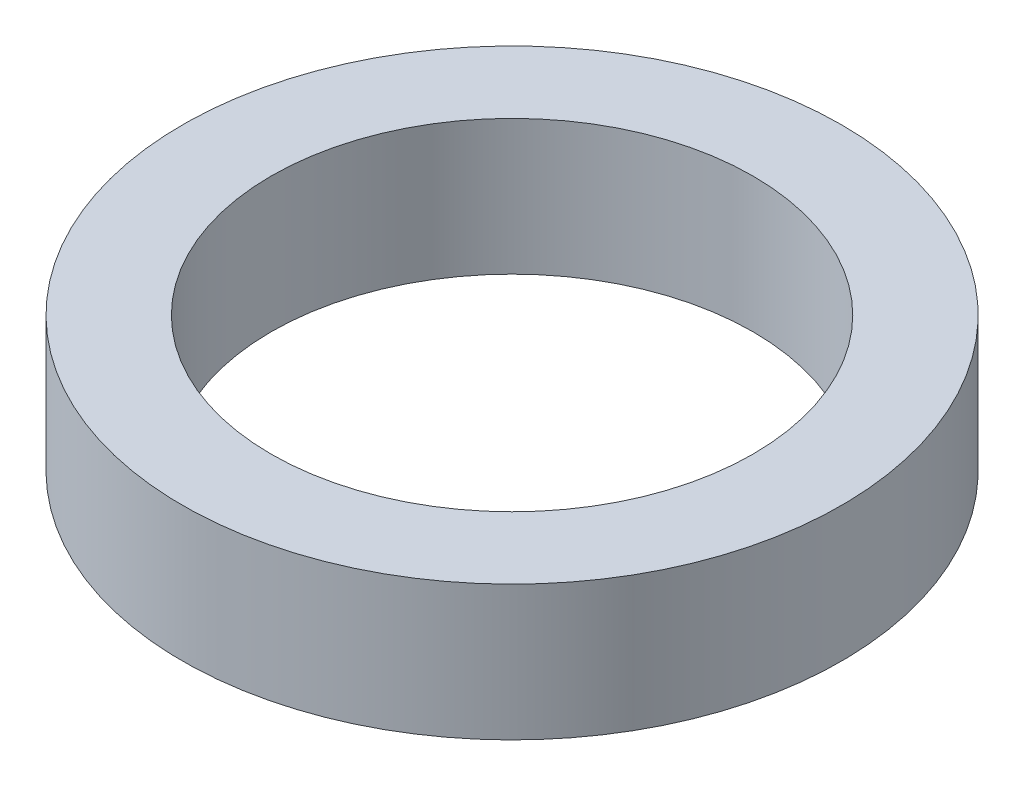
ISO-10303-21;
HEADER;
FILE_DESCRIPTION(('STEP AP214'),'2;1');
FILE_NAME('part.step','',(''),(''),'','','');
FILE_SCHEMA(('AUTOMOTIVE_DESIGN { 1 0 10303 214 1 1 1 1 }'));
ENDSEC;
DATA;
#1=APPLICATION_CONTEXT('core data for automotive mechanical design processes');
#2=APPLICATION_PROTOCOL_DEFINITION('international standard','automotive_design',2000,#1);
#3=PRODUCT_CONTEXT('',#1,'mechanical');
#4=PRODUCT('Part','Part','',(#3));
#5=PRODUCT_RELATED_PRODUCT_CATEGORY('part','',(#4));
#6=PRODUCT_DEFINITION_FORMATION('','',#4);
#7=PRODUCT_DEFINITION_CONTEXT('part definition',#1,'design');
#8=PRODUCT_DEFINITION('design','',#6,#7);
#9=PRODUCT_DEFINITION_SHAPE('','',#8);
#10=(LENGTH_UNIT() NAMED_UNIT(*) SI_UNIT(.MILLI.,.METRE.));
#11=(NAMED_UNIT(*) PLANE_ANGLE_UNIT() SI_UNIT($,.RADIAN.));
#12=(NAMED_UNIT(*) SI_UNIT($,.STERADIAN.) SOLID_ANGLE_UNIT());
#13=UNCERTAINTY_MEASURE_WITH_UNIT(LENGTH_MEASURE(1.E-05),#10,'distance_accuracy_value','');
#14=(GEOMETRIC_REPRESENTATION_CONTEXT(3) GLOBAL_UNCERTAINTY_ASSIGNED_CONTEXT((#13)) GLOBAL_UNIT_ASSIGNED_CONTEXT((#10,
#11,#12)) REPRESENTATION_CONTEXT('',''));
#15=CARTESIAN_POINT('',(0.,0.,0.));
#16=DIRECTION('',(0.,0.,1.));
#17=DIRECTION('',(1.,0.,0.));
#18=AXIS2_PLACEMENT_3D('',#15,#16,#17);
#19=CARTESIAN_POINT('',(0.,7.,0.));
#20=DIRECTION('',(0.,1.,0.));
#21=DIRECTION('',(0.,0.,-1.));
#22=AXIS2_PLACEMENT_3D('',#19,#20,#21);
#23=PLANE('',#22);
#24=CARTESIAN_POINT('',(0.,7.,0.));
#25=DIRECTION('',(0.,-1.,0.));
#26=DIRECTION('',(0.,0.,-1.));
#27=AXIS2_PLACEMENT_3D('',#24,#25,#26);
#28=CIRCLE('',#27,17.1);
#29=CARTESIAN_POINT('',(0.,7.,-17.1));
#30=VERTEX_POINT('',#29);
#31=EDGE_CURVE('E10',#30,#30,#28,.T.);
#32=ORIENTED_EDGE('',*,*,#31,.F.);
#33=EDGE_LOOP('',(#32));
#34=FACE_BOUND('',#33,.T.);
#35=CARTESIAN_POINT('',(0.,7.,0.));
#36=DIRECTION('',(0.,-1.,0.));
#37=DIRECTION('',(0.,0.,-1.));
#38=AXIS2_PLACEMENT_3D('',#35,#36,#37);
#39=CIRCLE('',#38,12.5);
#40=CARTESIAN_POINT('',(0.,7.,-12.5));
#41=VERTEX_POINT('',#40);
#42=EDGE_CURVE('E50',#41,#41,#39,.T.);
#43=ORIENTED_EDGE('',*,*,#42,.T.);
#44=EDGE_LOOP('',(#43));
#45=FACE_BOUND('',#44,.T.);
#46=ADVANCED_FACE('F39',(#34,#45),#23,.T.);
#47=CARTESIAN_POINT('',(0.,0.,0.));
#48=DIRECTION('',(0.,1.,0.));
#49=DIRECTION('',(0.,0.,-1.));
#50=AXIS2_PLACEMENT_3D('',#47,#48,#49);
#51=PLANE('',#50);
#52=CARTESIAN_POINT('',(0.,0.,0.));
#53=DIRECTION('',(0.,-1.,0.));
#54=DIRECTION('',(0.,0.,-1.));
#55=AXIS2_PLACEMENT_3D('',#52,#53,#54);
#56=CIRCLE('',#55,17.1);
#57=CARTESIAN_POINT('',(0.,0.,-17.1));
#58=VERTEX_POINT('',#57);
#59=EDGE_CURVE('E43',#58,#58,#56,.T.);
#60=ORIENTED_EDGE('',*,*,#59,.T.);
#61=EDGE_LOOP('',(#60));
#62=FACE_BOUND('',#61,.T.);
#63=CARTESIAN_POINT('',(0.,0.,0.));
#64=DIRECTION('',(0.,-1.,0.));
#65=DIRECTION('',(0.,0.,-1.));
#66=AXIS2_PLACEMENT_3D('',#63,#64,#65);
#67=CIRCLE('',#66,12.5);
#68=CARTESIAN_POINT('',(0.,0.,-12.5));
#69=VERTEX_POINT('',#68);
#70=EDGE_CURVE('E52',#69,#69,#67,.T.);
#71=ORIENTED_EDGE('',*,*,#70,.F.);
#72=EDGE_LOOP('',(#71));
#73=FACE_BOUND('',#72,.T.);
#74=ADVANCED_FACE('F65',(#62,#73),#51,.F.);
#75=CARTESIAN_POINT('',(0.,7.,0.));
#76=DIRECTION('',(0.,-1.,0.));
#77=DIRECTION('',(0.,0.,1.));
#78=AXIS2_PLACEMENT_3D('',#75,#76,#77);
#79=CYLINDRICAL_SURFACE('',#78,17.1);
#80=ORIENTED_EDGE('',*,*,#31,.T.);
#81=EDGE_LOOP('',(#80));
#82=FACE_BOUND('',#81,.T.);
#83=ORIENTED_EDGE('',*,*,#59,.F.);
#84=EDGE_LOOP('',(#83));
#85=FACE_BOUND('',#84,.T.);
#86=ADVANCED_FACE('F41',(#82,#85),#79,.T.);
#87=CARTESIAN_POINT('',(0.,7.,0.));
#88=DIRECTION('',(0.,-1.,0.));
#89=DIRECTION('',(0.,0.,1.));
#90=AXIS2_PLACEMENT_3D('',#87,#88,#89);
#91=CYLINDRICAL_SURFACE('',#90,12.5);
#92=ORIENTED_EDGE('',*,*,#42,.F.);
#93=EDGE_LOOP('',(#92));
#94=FACE_BOUND('',#93,.T.);
#95=ORIENTED_EDGE('',*,*,#70,.T.);
#96=EDGE_LOOP('',(#95));
#97=FACE_BOUND('',#96,.T.);
#98=ADVANCED_FACE('F59',(#94,#97),#91,.F.);
#99=CLOSED_SHELL('',(#46,#74,#86,#98));
#100=MANIFOLD_SOLID_BREP('B2',#99);
#101=ADVANCED_BREP_SHAPE_REPRESENTATION('',(#18,#100),#14);
#102=SHAPE_DEFINITION_REPRESENTATION(#9,#101);
ENDSEC;
END-ISO-10303-21;
